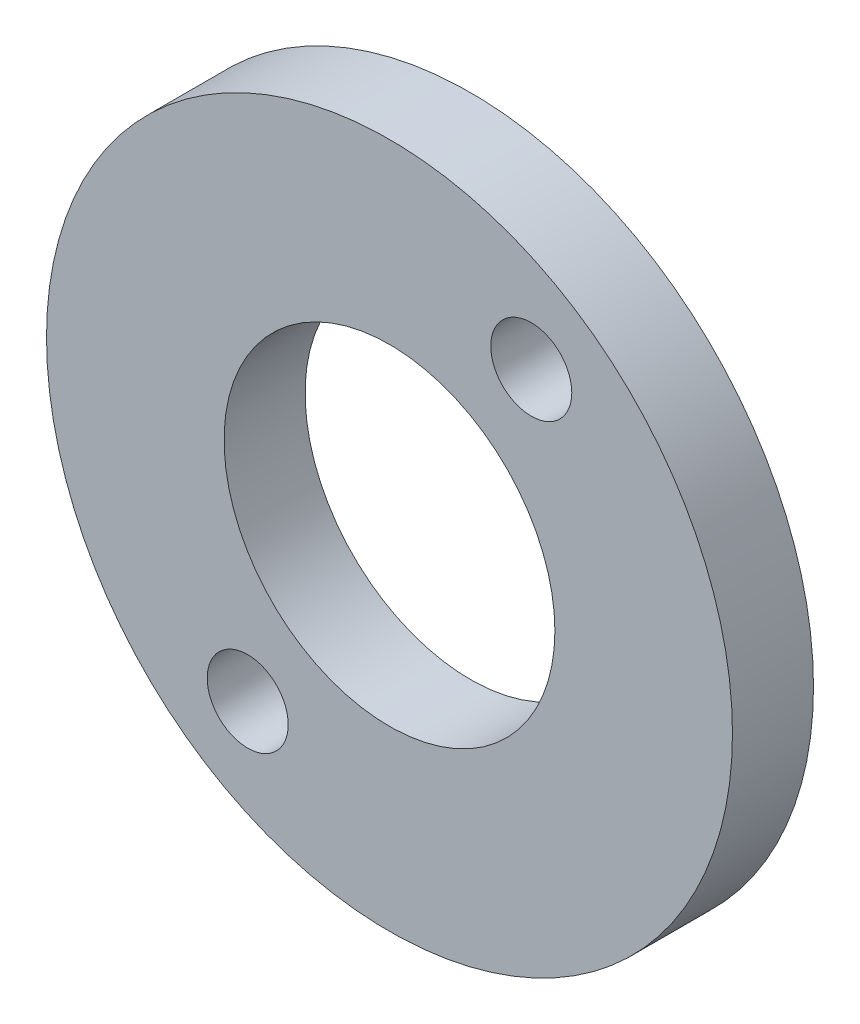
ISO-10303-21;
HEADER;
FILE_DESCRIPTION(('STEP AP214'),'2;1');
FILE_NAME('part.step','',(''),(''),'','','');
FILE_SCHEMA(('AUTOMOTIVE_DESIGN { 1 0 10303 214 1 1 1 1 }'));
ENDSEC;
DATA;
#1=APPLICATION_CONTEXT('core data for automotive mechanical design processes');
#2=APPLICATION_PROTOCOL_DEFINITION('international standard','automotive_design',2000,#1);
#3=PRODUCT_CONTEXT('',#1,'mechanical');
#4=PRODUCT('Part','Part','',(#3));
#5=PRODUCT_RELATED_PRODUCT_CATEGORY('part','',(#4));
#6=PRODUCT_DEFINITION_FORMATION('','',#4);
#7=PRODUCT_DEFINITION_CONTEXT('part definition',#1,'design');
#8=PRODUCT_DEFINITION('design','',#6,#7);
#9=PRODUCT_DEFINITION_SHAPE('','',#8);
#10=(LENGTH_UNIT() NAMED_UNIT(*) SI_UNIT(.MILLI.,.METRE.));
#11=(NAMED_UNIT(*) PLANE_ANGLE_UNIT() SI_UNIT($,.RADIAN.));
#12=(NAMED_UNIT(*) SI_UNIT($,.STERADIAN.) SOLID_ANGLE_UNIT());
#13=UNCERTAINTY_MEASURE_WITH_UNIT(LENGTH_MEASURE(1.E-05),#10,'distance_accuracy_value','');
#14=(GEOMETRIC_REPRESENTATION_CONTEXT(3) GLOBAL_UNCERTAINTY_ASSIGNED_CONTEXT((#13)) GLOBAL_UNIT_ASSIGNED_CONTEXT((#10,
#11,#12)) REPRESENTATION_CONTEXT('',''));
#15=CARTESIAN_POINT('',(0.,0.,0.));
#16=DIRECTION('',(0.,0.,1.));
#17=DIRECTION('',(1.,0.,0.));
#18=AXIS2_PLACEMENT_3D('',#15,#16,#17);
#19=CARTESIAN_POINT('',(-25.912099998066,-505.146272004471,132.258321614995));
#20=DIRECTION('',(0.,0.,1.));
#21=DIRECTION('',(1.,0.,0.));
#22=AXIS2_PLACEMENT_3D('',#19,#20,#21);
#23=PLANE('',#22);
#24=CARTESIAN_POINT('',(-31.162099998066,-513.093795203557,132.258321614995));
#25=DIRECTION('',(0.,0.,1.));
#26=DIRECTION('',(1.,0.,0.));
#27=AXIS2_PLACEMENT_3D('',#24,#25,#26);
#28=CIRCLE('',#27,1.5);
#29=CARTESIAN_POINT('',(-29.662099998066,-513.093795203557,132.258321614995));
#30=VERTEX_POINT('',#29);
#31=EDGE_CURVE('E57',#30,#30,#28,.T.);
#32=ORIENTED_EDGE('',*,*,#31,.F.);
#33=EDGE_LOOP('',(#32));
#34=FACE_BOUND('',#33,.T.);
#35=CARTESIAN_POINT('',(-25.912099998066,-505.146272004471,132.258321614995));
#36=DIRECTION('',(0.,0.,1.));
#37=DIRECTION('',(1.,0.,0.));
#38=AXIS2_PLACEMENT_3D('',#35,#36,#37);
#39=CIRCLE('',#38,12.7);
#40=CARTESIAN_POINT('',(-13.212099998066,-505.146272004471,132.258321614995));
#41=VERTEX_POINT('',#40);
#42=EDGE_CURVE('E10',#41,#41,#39,.T.);
#43=ORIENTED_EDGE('',*,*,#42,.T.);
#44=EDGE_LOOP('',(#43));
#45=FACE_BOUND('',#44,.T.);
#46=CARTESIAN_POINT('',(-25.912099998066,-505.146272004471,132.258321614995));
#47=DIRECTION('',(0.,0.,1.));
#48=DIRECTION('',(1.,0.,0.));
#49=AXIS2_PLACEMENT_3D('',#46,#47,#48);
#50=CIRCLE('',#49,6.12500000000001);
#51=CARTESIAN_POINT('',(-19.787099998066,-505.146272004471,132.258321614995));
#52=VERTEX_POINT('',#51);
#53=EDGE_CURVE('E51',#52,#52,#50,.T.);
#54=ORIENTED_EDGE('',*,*,#53,.F.);
#55=EDGE_LOOP('',(#54));
#56=FACE_BOUND('',#55,.T.);
#57=CARTESIAN_POINT('',(-20.662099998066,-497.198748805386,132.258321614995));
#58=DIRECTION('',(0.,0.,1.));
#59=DIRECTION('',(1.,0.,0.));
#60=AXIS2_PLACEMENT_3D('',#57,#58,#59);
#61=CIRCLE('',#60,1.5);
#62=CARTESIAN_POINT('',(-19.162099998066,-497.198748805386,132.258321614995));
#63=VERTEX_POINT('',#62);
#64=EDGE_CURVE('E65',#63,#63,#61,.T.);
#65=ORIENTED_EDGE('',*,*,#64,.F.);
#66=EDGE_LOOP('',(#65));
#67=FACE_BOUND('',#66,.T.);
#68=ADVANCED_FACE('F37',(#34,#45,#56,#67),#23,.T.);
#69=CARTESIAN_POINT('',(-25.912099998066,-505.146272004471,129.258321614995));
#70=DIRECTION('',(0.,0.,1.));
#71=DIRECTION('',(1.,0.,0.));
#72=AXIS2_PLACEMENT_3D('',#69,#70,#71);
#73=PLANE('',#72);
#74=CARTESIAN_POINT('',(-25.912099998066,-505.146272004471,129.258321614995));
#75=DIRECTION('',(0.,0.,1.));
#76=DIRECTION('',(1.,0.,0.));
#77=AXIS2_PLACEMENT_3D('',#74,#75,#76);
#78=CIRCLE('',#77,12.7);
#79=CARTESIAN_POINT('',(-13.212099998066,-505.146272004471,129.258321614995));
#80=VERTEX_POINT('',#79);
#81=EDGE_CURVE('E41',#80,#80,#78,.T.);
#82=ORIENTED_EDGE('',*,*,#81,.F.);
#83=EDGE_LOOP('',(#82));
#84=FACE_BOUND('',#83,.T.);
#85=CARTESIAN_POINT('',(-25.912099998066,-505.146272004471,129.258321614995));
#86=DIRECTION('',(0.,0.,1.));
#87=DIRECTION('',(1.,0.,0.));
#88=AXIS2_PLACEMENT_3D('',#85,#86,#87);
#89=CIRCLE('',#88,6.12500000000001);
#90=CARTESIAN_POINT('',(-19.787099998066,-505.146272004471,129.258321614995));
#91=VERTEX_POINT('',#90);
#92=EDGE_CURVE('E53',#91,#91,#89,.T.);
#93=ORIENTED_EDGE('',*,*,#92,.T.);
#94=EDGE_LOOP('',(#93));
#95=FACE_BOUND('',#94,.T.);
#96=CARTESIAN_POINT('',(-31.162099998066,-513.093795203557,129.258321614995));
#97=DIRECTION('',(0.,0.,1.));
#98=DIRECTION('',(1.,0.,0.));
#99=AXIS2_PLACEMENT_3D('',#96,#97,#98);
#100=CIRCLE('',#99,1.5);
#101=CARTESIAN_POINT('',(-29.662099998066,-513.093795203557,129.258321614995));
#102=VERTEX_POINT('',#101);
#103=EDGE_CURVE('E61',#102,#102,#100,.T.);
#104=ORIENTED_EDGE('',*,*,#103,.T.);
#105=EDGE_LOOP('',(#104));
#106=FACE_BOUND('',#105,.T.);
#107=CARTESIAN_POINT('',(-20.662099998066,-497.198748805386,129.258321614995));
#108=DIRECTION('',(0.,0.,1.));
#109=DIRECTION('',(1.,0.,0.));
#110=AXIS2_PLACEMENT_3D('',#107,#108,#109);
#111=CIRCLE('',#110,1.5);
#112=CARTESIAN_POINT('',(-19.162099998066,-497.198748805386,129.258321614995));
#113=VERTEX_POINT('',#112);
#114=EDGE_CURVE('E69',#113,#113,#111,.T.);
#115=ORIENTED_EDGE('',*,*,#114,.T.);
#116=EDGE_LOOP('',(#115));
#117=FACE_BOUND('',#116,.T.);
#118=ADVANCED_FACE('F80',(#84,#95,#106,#117),#73,.F.);
#119=CARTESIAN_POINT('',(-25.912099998066,-505.146272004471,132.258321614995));
#120=DIRECTION('',(0.,0.,-1.));
#121=DIRECTION('',(-1.,0.,0.));
#122=AXIS2_PLACEMENT_3D('',#119,#120,#121);
#123=CYLINDRICAL_SURFACE('',#122,12.7);
#124=ORIENTED_EDGE('',*,*,#42,.F.);
#125=EDGE_LOOP('',(#124));
#126=FACE_BOUND('',#125,.T.);
#127=ORIENTED_EDGE('',*,*,#81,.T.);
#128=EDGE_LOOP('',(#127));
#129=FACE_BOUND('',#128,.T.);
#130=ADVANCED_FACE('F39',(#126,#129),#123,.T.);
#131=CARTESIAN_POINT('',(-25.912099998066,-505.146272004471,132.258321614995));
#132=DIRECTION('',(0.,0.,-1.));
#133=DIRECTION('',(-1.,0.,0.));
#134=AXIS2_PLACEMENT_3D('',#131,#132,#133);
#135=CYLINDRICAL_SURFACE('',#134,6.12500000000001);
#136=ORIENTED_EDGE('',*,*,#53,.T.);
#137=EDGE_LOOP('',(#136));
#138=FACE_BOUND('',#137,.T.);
#139=ORIENTED_EDGE('',*,*,#92,.F.);
#140=EDGE_LOOP('',(#139));
#141=FACE_BOUND('',#140,.T.);
#142=ADVANCED_FACE('F89',(#138,#141),#135,.F.);
#143=CARTESIAN_POINT('',(-31.162099998066,-513.093795203557,132.258321614995));
#144=DIRECTION('',(0.,0.,-1.));
#145=DIRECTION('',(-1.,0.,0.));
#146=AXIS2_PLACEMENT_3D('',#143,#144,#145);
#147=CYLINDRICAL_SURFACE('',#146,1.5);
#148=ORIENTED_EDGE('',*,*,#31,.T.);
#149=EDGE_LOOP('',(#148));
#150=FACE_BOUND('',#149,.T.);
#151=ORIENTED_EDGE('',*,*,#103,.F.);
#152=EDGE_LOOP('',(#151));
#153=FACE_BOUND('',#152,.T.);
#154=ADVANCED_FACE('F92',(#150,#153),#147,.F.);
#155=CARTESIAN_POINT('',(-20.662099998066,-497.198748805386,132.258321614995));
#156=DIRECTION('',(0.,0.,-1.));
#157=DIRECTION('',(-1.,0.,0.));
#158=AXIS2_PLACEMENT_3D('',#155,#156,#157);
#159=CYLINDRICAL_SURFACE('',#158,1.5);
#160=ORIENTED_EDGE('',*,*,#64,.T.);
#161=EDGE_LOOP('',(#160));
#162=FACE_BOUND('',#161,.T.);
#163=ORIENTED_EDGE('',*,*,#114,.F.);
#164=EDGE_LOOP('',(#163));
#165=FACE_BOUND('',#164,.T.);
#166=ADVANCED_FACE('F76',(#162,#165),#159,.F.);
#167=CLOSED_SHELL('',(#68,#118,#130,#142,#154,#166));
#168=MANIFOLD_SOLID_BREP('B2',#167);
#169=ADVANCED_BREP_SHAPE_REPRESENTATION('',(#18,#168),#14);
#170=SHAPE_DEFINITION_REPRESENTATION(#9,#169);
ENDSEC;
END-ISO-10303-21;
